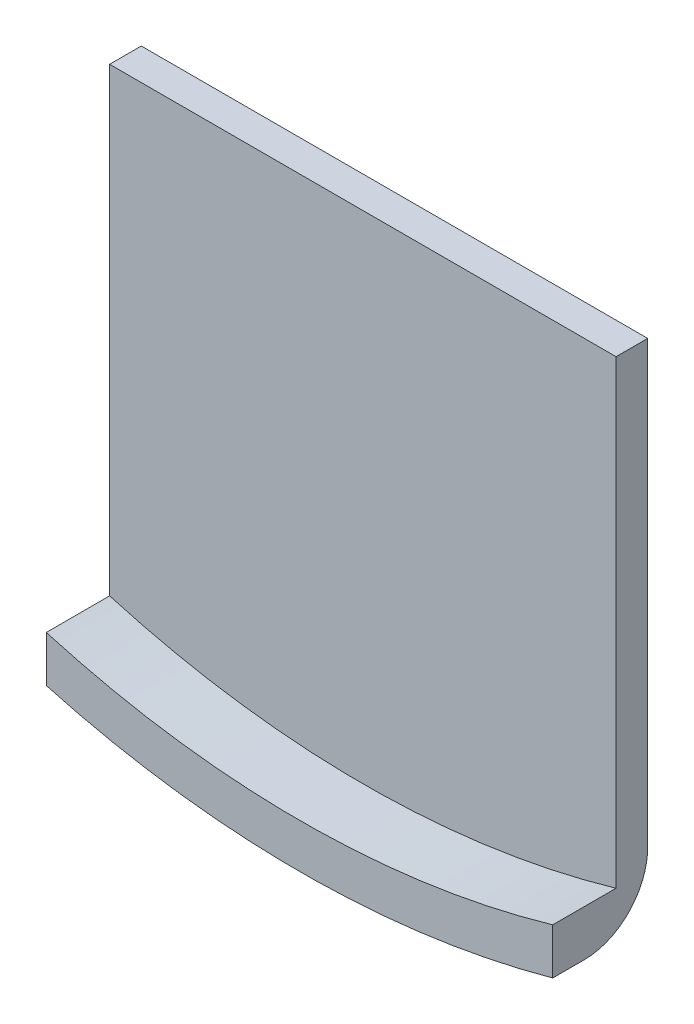
ISO-10303-21;
HEADER;
FILE_DESCRIPTION(('STEP AP214'),'2;1');
FILE_NAME('part.step','',(''),(''),'','','');
FILE_SCHEMA(('AUTOMOTIVE_DESIGN { 1 0 10303 214 1 1 1 1 }'));
ENDSEC;
DATA;
#1=APPLICATION_CONTEXT('core data for automotive mechanical design processes');
#2=APPLICATION_PROTOCOL_DEFINITION('international standard','automotive_design',2000,#1);
#3=PRODUCT_CONTEXT('',#1,'mechanical');
#4=PRODUCT('Part','Part','',(#3));
#5=PRODUCT_RELATED_PRODUCT_CATEGORY('part','',(#4));
#6=PRODUCT_DEFINITION_FORMATION('','',#4);
#7=PRODUCT_DEFINITION_CONTEXT('part definition',#1,'design');
#8=PRODUCT_DEFINITION('design','',#6,#7);
#9=PRODUCT_DEFINITION_SHAPE('','',#8);
#10=(LENGTH_UNIT() NAMED_UNIT(*) SI_UNIT(.MILLI.,.METRE.));
#11=(NAMED_UNIT(*) PLANE_ANGLE_UNIT() SI_UNIT($,.RADIAN.));
#12=(NAMED_UNIT(*) SI_UNIT($,.STERADIAN.) SOLID_ANGLE_UNIT());
#13=UNCERTAINTY_MEASURE_WITH_UNIT(LENGTH_MEASURE(1.E-05),#10,'distance_accuracy_value','');
#14=(GEOMETRIC_REPRESENTATION_CONTEXT(3) GLOBAL_UNCERTAINTY_ASSIGNED_CONTEXT((#13)) GLOBAL_UNIT_ASSIGNED_CONTEXT((#10,
#11,#12)) REPRESENTATION_CONTEXT('',''));
#15=CARTESIAN_POINT('',(0.,0.,0.));
#16=DIRECTION('',(0.,0.,1.));
#17=DIRECTION('',(1.,0.,0.));
#18=AXIS2_PLACEMENT_3D('',#15,#16,#17);
#19=CARTESIAN_POINT('',(-40.,-64.5683229480096,15.));
#20=DIRECTION('',(0.,-1.,0.));
#21=DIRECTION('',(0.,0.,-1.));
#22=AXIS2_PLACEMENT_3D('',#19,#20,#21);
#23=PLANE('',#22);
#24=DIRECTION('',(-1.,0.,0.));
#25=VECTOR('',#24,1.);
#26=CARTESIAN_POINT('',(-40.,-64.5683229480096,5.));
#27=LINE('',#26,#25);
#28=CARTESIAN_POINT('',(40.,-64.5683229480096,5.));
#29=VERTEX_POINT('',#28);
#30=CARTESIAN_POINT('',(-40.,-64.5683229480096,5.));
#31=VERTEX_POINT('',#30);
#32=EDGE_CURVE('E129',#29,#31,#27,.T.);
#33=ORIENTED_EDGE('',*,*,#32,.F.);
#34=DIRECTION('',(0.,0.,-1.));
#35=VECTOR('',#34,1.);
#36=CARTESIAN_POINT('',(40.,-64.5683229480096,15.));
#37=LINE('',#36,#35);
#38=CARTESIAN_POINT('',(40.,-64.5683229480096,0.));
#39=VERTEX_POINT('',#38);
#40=EDGE_CURVE('E127',#29,#39,#37,.T.);
#41=ORIENTED_EDGE('',*,*,#40,.T.);
#42=DIRECTION('',(-1.,0.,0.));
#43=VECTOR('',#42,1.);
#44=CARTESIAN_POINT('',(-40.,-64.5683229480096,0.));
#45=LINE('',#44,#43);
#46=CARTESIAN_POINT('',(-40.,-64.5683229480096,0.));
#47=VERTEX_POINT('',#46);
#48=EDGE_CURVE('E155',#39,#47,#45,.T.);
#49=ORIENTED_EDGE('',*,*,#48,.T.);
#50=DIRECTION('',(0.,0.,-1.));
#51=VECTOR('',#50,1.);
#52=CARTESIAN_POINT('',(-40.,-64.5683229480096,15.));
#53=LINE('',#52,#51);
#54=EDGE_CURVE('E164',#31,#47,#53,.T.);
#55=ORIENTED_EDGE('',*,*,#54,.F.);
#56=EDGE_LOOP('',(#33,#41,#49,#55));
#57=FACE_BOUND('',#56,.T.);
#58=ADVANCED_FACE('F39',(#57),#23,.F.);
#59=CARTESIAN_POINT('',(0.,0.,15.));
#60=DIRECTION('',(0.,0.,-1.));
#61=DIRECTION('',(-1.,0.,0.));
#62=AXIS2_PLACEMENT_3D('',#59,#60,#61);
#63=CYLINDRICAL_SURFACE('',#62,150.);
#64=DIRECTION('',(0.,0.,-1.));
#65=VECTOR('',#64,1.);
#66=CARTESIAN_POINT('',(-40.,-144.56832294801,15.));
#67=LINE('',#66,#65);
#68=CARTESIAN_POINT('',(-40.,-144.56832294801,15.));
#69=VERTEX_POINT('',#68);
#70=CARTESIAN_POINT('',(-40.,-144.56832294801,10.));
#71=VERTEX_POINT('',#70);
#72=EDGE_CURVE('E152',#69,#71,#67,.T.);
#73=ORIENTED_EDGE('',*,*,#72,.T.);
#74=CARTESIAN_POINT('',(0.,0.,10.));
#75=DIRECTION('',(0.,0.,1.));
#76=DIRECTION('',(1.,0.,0.));
#77=AXIS2_PLACEMENT_3D('',#74,#75,#76);
#78=CIRCLE('',#77,150.);
#79=CARTESIAN_POINT('',(40.,-144.56832294801,10.));
#80=VERTEX_POINT('',#79);
#81=EDGE_CURVE('E172',#71,#80,#78,.T.);
#82=ORIENTED_EDGE('',*,*,#81,.T.);
#83=DIRECTION('',(0.,0.,-1.));
#84=VECTOR('',#83,1.);
#85=CARTESIAN_POINT('',(40.,-144.56832294801,15.));
#86=LINE('',#85,#84);
#87=CARTESIAN_POINT('',(40.,-144.56832294801,15.));
#88=VERTEX_POINT('',#87);
#89=EDGE_CURVE('E169',#88,#80,#86,.T.);
#90=ORIENTED_EDGE('',*,*,#89,.F.);
#91=CARTESIAN_POINT('',(0.,0.,15.));
#92=DIRECTION('',(0.,0.,1.));
#93=DIRECTION('',(1.,0.,0.));
#94=AXIS2_PLACEMENT_3D('',#91,#92,#93);
#95=CIRCLE('',#94,150.);
#96=EDGE_CURVE('E141',#69,#88,#95,.T.);
#97=ORIENTED_EDGE('',*,*,#96,.F.);
#98=EDGE_LOOP('',(#73,#82,#90,#97));
#99=FACE_BOUND('',#98,.T.);
#100=ADVANCED_FACE('F186',(#99),#63,.T.);
#101=CARTESIAN_POINT('',(40.,-64.5683229480096,15.));
#102=DIRECTION('',(-1.,0.,0.));
#103=DIRECTION('',(0.,-1.,0.));
#104=AXIS2_PLACEMENT_3D('',#101,#102,#103);
#105=PLANE('',#104);
#106=ORIENTED_EDGE('',*,*,#89,.T.);
#107=CARTESIAN_POINT('',(40.,-144.56832294801,10.));
#108=CARTESIAN_POINT('',(40.,-144.568359035472,9.72626188347201));
#109=CARTESIAN_POINT('',(40.,-144.556662340316,9.45253158487849));
#110=CARTESIAN_POINT('',(40.,-144.510066128344,8.90708385302003));
#111=CARTESIAN_POINT('',(40.,-144.47516931396,8.63536618904336));
#112=CARTESIAN_POINT('',(40.,-144.382514860294,8.09633800191904));
#113=CARTESIAN_POINT('',(40.,-144.324796454121,7.82902073118008));
#114=CARTESIAN_POINT('',(40.,-144.187002586657,7.30021461901987));
#115=CARTESIAN_POINT('',(40.,-144.106927107247,7.03872578232193));
#116=CARTESIAN_POINT('',(40.,-143.925081115136,6.52337484364123));
#117=CARTESIAN_POINT('',(40.,-143.823308199884,6.26951358981309));
#118=CARTESIAN_POINT('',(40.,-143.598912627219,5.77117394913581));
#119=CARTESIAN_POINT('',(40.,-143.476289263047,5.52669588068891));
#120=CARTESIAN_POINT('',(40.,-143.211182020109,5.04874552096158));
#121=CARTESIAN_POINT('',(40.,-143.068697164055,4.81527377200629));
#122=CARTESIAN_POINT('',(40.,-142.764997650342,4.36085271996683));
#123=CARTESIAN_POINT('',(40.,-142.603782854487,4.13990350929671));
#124=CARTESIAN_POINT('',(40.,-142.261370418195,3.70876509600919));
#125=CARTESIAN_POINT('',(40.,-142.07991463779,3.49878093871475));
#126=CARTESIAN_POINT('',(40.,-141.700328569066,3.09434927042743));
#127=CARTESIAN_POINT('',(40.,-141.502192905535,2.89990680751193));
#128=CARTESIAN_POINT('',(40.,-141.090768141169,2.52777801552542));
#129=CARTESIAN_POINT('',(40.,-140.877478862613,2.35009188302719));
#130=CARTESIAN_POINT('',(40.,-140.437278607051,2.01247575031213));
#131=CARTESIAN_POINT('',(40.,-140.210367104579,1.85254643572783));
#132=CARTESIAN_POINT('',(40.,-139.736410431134,1.5460758109461));
#133=CARTESIAN_POINT('',(40.,-139.488939702133,1.40019242583963));
#134=CARTESIAN_POINT('',(40.,-138.982968287429,1.12920553635408));
#135=CARTESIAN_POINT('',(40.,-138.724470700937,1.00409624094301));
#136=CARTESIAN_POINT('',(40.,-138.198139533581,0.775235817273424));
#137=CARTESIAN_POINT('',(40.,-137.930304226177,0.671488663616188));
#138=CARTESIAN_POINT('',(40.,-137.387179725388,0.485902393989954));
#139=CARTESIAN_POINT('',(40.,-137.1118915963,0.404060167882566));
#140=CARTESIAN_POINT('',(40.,-136.615767391316,0.277924895934444));
#141=CARTESIAN_POINT('',(40.,-136.396010518631,0.229339760186271));
#142=CARTESIAN_POINT('',(40.,-135.953893134258,0.145982251654777));
#143=CARTESIAN_POINT('',(40.,-135.731532728138,0.111209320789587));
#144=CARTESIAN_POINT('',(40.,-135.285431887614,0.0556086102170756));
#145=CARTESIAN_POINT('',(40.,-135.061694152764,0.0347591235195763));
#146=CARTESIAN_POINT('',(40.,-134.613330578354,0.00695050811814122));
#147=CARTESIAN_POINT('',(40.,-134.388704637764,-6.99206341696163E-06));
#148=CARTESIAN_POINT('',(40.,-134.164078649987,0.));
#149=B_SPLINE_CURVE_WITH_KNOTS('',3,(#107,#108,#109,#110,#111,#112,#113,#114,#115,#116,#117,
#118,#119,#120,#121,#122,#123,#124,#125,#126,#127,#128,#129,#130,#131,#132,#133,#134,#135,#136,
#137,#138,#139,#140,#141,#142,#143,#144,#145,#146,#147,#148),.UNSPECIFIED.,.F.,.F.,(4,2,2,2,2,2,
2,2,2,2,2,2,2,2,2,2,2,2,2,2,4),(0.,0.820952883759586,1.64181015681192,2.46126236882362,
3.28071524489073,4.10025890590844,4.91983035218551,5.73944213988814,6.55905997538865,
7.39068476193907,8.2225785789477,9.05448215390055,9.88641783944645,10.7472485970723,
11.6078389832484,12.4685893449104,13.3292174293093,14.0039898517018,14.6787350071536,
15.3524257471753,16.0261954576197),.UNSPECIFIED.);
#150=CARTESIAN_POINT('',(40.,-134.164078649987,0.));
#151=VERTEX_POINT('',#150);
#152=EDGE_CURVE('E68',#80,#151,#149,.T.);
#153=ORIENTED_EDGE('',*,*,#152,.T.);
#154=DIRECTION('',(0.,1.,0.));
#155=VECTOR('',#154,1.);
#156=CARTESIAN_POINT('',(40.,-64.5683229480096,0.));
#157=LINE('',#156,#155);
#158=EDGE_CURVE('E139',#151,#39,#157,.T.);
#159=ORIENTED_EDGE('',*,*,#158,.T.);
#160=ORIENTED_EDGE('',*,*,#40,.F.);
#161=DIRECTION('',(0.,1.,0.));
#162=VECTOR('',#161,1.);
#163=CARTESIAN_POINT('',(40.,-64.5683229480096,5.));
#164=LINE('',#163,#162);
#165=CARTESIAN_POINT('',(40.,-137.291660343955,5.));
#166=VERTEX_POINT('',#165);
#167=EDGE_CURVE('E118',#166,#29,#164,.T.);
#168=ORIENTED_EDGE('',*,*,#167,.F.);
#169=DIRECTION('',(0.,0.,1.));
#170=VECTOR('',#169,1.);
#171=CARTESIAN_POINT('',(40.,-137.291660343955,5.));
#172=LINE('',#171,#170);
#173=CARTESIAN_POINT('',(40.,-137.291660343955,15.));
#174=VERTEX_POINT('',#173);
#175=EDGE_CURVE('E103',#166,#174,#172,.T.);
#176=ORIENTED_EDGE('',*,*,#175,.T.);
#177=DIRECTION('',(0.,1.,0.));
#178=VECTOR('',#177,1.);
#179=CARTESIAN_POINT('',(40.,-64.5683229480096,15.));
#180=LINE('',#179,#178);
#181=EDGE_CURVE('E145',#88,#174,#180,.T.);
#182=ORIENTED_EDGE('',*,*,#181,.F.);
#183=EDGE_LOOP('',(#106,#153,#159,#160,#168,#176,#182));
#184=FACE_BOUND('',#183,.T.);
#185=ADVANCED_FACE('F125',(#184),#105,.F.);
#186=CARTESIAN_POINT('',(-40.,-144.56832294801,15.));
#187=DIRECTION('',(1.,0.,0.));
#188=DIRECTION('',(0.,1.,0.));
#189=AXIS2_PLACEMENT_3D('',#186,#187,#188);
#190=PLANE('',#189);
#191=DIRECTION('',(0.,-1.,0.));
#192=VECTOR('',#191,1.);
#193=CARTESIAN_POINT('',(-40.,-144.56832294801,0.));
#194=LINE('',#193,#192);
#195=CARTESIAN_POINT('',(-40.,-134.164078649987,0.));
#196=VERTEX_POINT('',#195);
#197=EDGE_CURVE('E146',#47,#196,#194,.T.);
#198=ORIENTED_EDGE('',*,*,#197,.T.);
#199=CARTESIAN_POINT('',(-40.,-134.164078649987,0.));
#200=CARTESIAN_POINT('',(-40.,-134.465987202941,-2.39595527518265E-05));
#201=CARTESIAN_POINT('',(-40.,-134.767899477535,0.012555323761179));
#202=CARTESIAN_POINT('',(-40.,-135.369648522833,0.06279369056643));
#203=CARTESIAN_POINT('',(-40.,-135.669485162292,0.100454345624216));
#204=CARTESIAN_POINT('',(-40.,-136.265141664081,0.200759058677123));
#205=CARTESIAN_POINT('',(-40.,-136.560958987879,0.263418210067454));
#206=CARTESIAN_POINT('',(-40.,-137.146263315266,0.41341094769574));
#207=CARTESIAN_POINT('',(-40.,-137.435750547601,0.500743640724577));
#208=CARTESIAN_POINT('',(-40.,-138.006593544041,0.699744333568046));
#209=CARTESIAN_POINT('',(-40.,-138.287940187001,0.811438517786292));
#210=CARTESIAN_POINT('',(-40.,-138.840049715946,1.05849250456056));
#211=CARTESIAN_POINT('',(-40.,-139.110812640105,1.19385222174744));
#212=CARTESIAN_POINT('',(-40.,-139.639500488651,1.4873691713725));
#213=CARTESIAN_POINT('',(-40.,-139.897432335986,1.64551392677204));
#214=CARTESIAN_POINT('',(-40.,-140.398532708538,1.98368164261669));
#215=CARTESIAN_POINT('',(-40.,-140.641701667589,2.16370395968197));
#216=CARTESIAN_POINT('',(-40.,-141.105870141456,2.54009725066669));
#217=CARTESIAN_POINT('',(-40.,-141.327249842366,2.73599937675167));
#218=CARTESIAN_POINT('',(-40.,-141.752147579857,3.14629789910924));
#219=CARTESIAN_POINT('',(-40.,-141.955666321474,3.36069356471283));
#220=CARTESIAN_POINT('',(-40.,-142.343145289896,3.80656415878805));
#221=CARTESIAN_POINT('',(-40.,-142.527101805514,4.03804231395132));
#222=CARTESIAN_POINT('',(-40.,-142.873777718169,4.51638409837735));
#223=CARTESIAN_POINT('',(-40.,-143.036498232104,4.76324691748007));
#224=CARTESIAN_POINT('',(-40.,-143.333455567899,5.26086173728838));
#225=CARTESIAN_POINT('',(-40.,-143.468541241983,5.51110745111039));
#226=CARTESIAN_POINT('',(-40.,-143.716520396778,6.0223524845566));
#227=CARTESIAN_POINT('',(-40.,-143.829415178156,6.28335117283531));
#228=CARTESIAN_POINT('',(-40.,-144.031922675609,6.81396207839342));
#229=CARTESIAN_POINT('',(-40.,-144.121556783862,7.08356612342291));
#230=CARTESIAN_POINT('',(-40.,-144.276839895717,7.62947819685111));
#231=CARTESIAN_POINT('',(-40.,-144.342497283409,7.90578384574711));
#232=CARTESIAN_POINT('',(-40.,-144.453199682746,8.48367392881396));
#233=CARTESIAN_POINT('',(-40.,-144.496372683838,8.78562251276978));
#234=CARTESIAN_POINT('',(-40.,-144.539539441546,9.24025996913471));
#235=CARTESIAN_POINT('',(-40.,-144.550329557686,9.39199769085177));
#236=CARTESIAN_POINT('',(-40.,-144.564721351479,9.69581543929119));
#237=CARTESIAN_POINT('',(-40.,-144.568322944374,9.84789547002847));
#238=CARTESIAN_POINT('',(-40.,-144.56832294801,10.));
#239=B_SPLINE_CURVE_WITH_KNOTS('',3,(#199,#200,#201,#202,#203,#204,#205,#206,#207,#208,#209,
#210,#211,#212,#213,#214,#215,#216,#217,#218,#219,#220,#221,#222,#223,#224,#225,#226,#227,#228,
#229,#230,#231,#232,#233,#234,#235,#236,#237,#238),.UNSPECIFIED.,.F.,.F.,(4,2,2,2,2,2,2,2,2,2,2,
2,2,2,2,2,2,2,2,4),(0.,0.905470004576359,1.81099675007617,2.71707105679736,3.62311256684243,
4.53013275695387,5.43714967522091,6.34367178749364,7.2501672470258,8.13590181946816,
9.02160141306667,9.90746873576922,10.7932894478436,11.6453697367217,12.4974000680244,
13.3486440118379,14.1995900101399,15.1131452912166,15.5693620346243,16.0255841571426),.UNSPECIFIED.);
#240=EDGE_CURVE('E11',#196,#71,#239,.T.);
#241=ORIENTED_EDGE('',*,*,#240,.T.);
#242=ORIENTED_EDGE('',*,*,#72,.F.);
#243=DIRECTION('',(0.,-1.,0.));
#244=VECTOR('',#243,1.);
#245=CARTESIAN_POINT('',(-40.,-144.56832294801,15.));
#246=LINE('',#245,#244);
#247=CARTESIAN_POINT('',(-40.,-137.291660343955,15.));
#248=VERTEX_POINT('',#247);
#249=EDGE_CURVE('E149',#248,#69,#246,.T.);
#250=ORIENTED_EDGE('',*,*,#249,.F.);
#251=DIRECTION('',(0.,0.,1.));
#252=VECTOR('',#251,1.);
#253=CARTESIAN_POINT('',(-40.,-137.291660343955,5.));
#254=LINE('',#253,#252);
#255=CARTESIAN_POINT('',(-40.,-137.291660343955,5.));
#256=VERTEX_POINT('',#255);
#257=EDGE_CURVE('E113',#256,#248,#254,.T.);
#258=ORIENTED_EDGE('',*,*,#257,.F.);
#259=DIRECTION('',(0.,-1.,0.));
#260=VECTOR('',#259,1.);
#261=CARTESIAN_POINT('',(-40.,-137.291660343955,5.));
#262=LINE('',#261,#260);
#263=EDGE_CURVE('E114',#31,#256,#262,.T.);
#264=ORIENTED_EDGE('',*,*,#263,.F.);
#265=ORIENTED_EDGE('',*,*,#54,.T.);
#266=EDGE_LOOP('',(#198,#241,#242,#250,#258,#264,#265));
#267=FACE_BOUND('',#266,.T.);
#268=ADVANCED_FACE('F185',(#267),#190,.F.);
#269=CARTESIAN_POINT('',(0.,0.,15.));
#270=DIRECTION('',(0.,0.,1.));
#271=DIRECTION('',(1.,0.,0.));
#272=AXIS2_PLACEMENT_3D('',#269,#270,#271);
#273=PLANE('',#272);
#274=CARTESIAN_POINT('',(0.,0.,15.));
#275=DIRECTION('',(0.,0.,1.));
#276=DIRECTION('',(1.,0.,0.));
#277=AXIS2_PLACEMENT_3D('',#274,#275,#276);
#278=CIRCLE('',#277,143.);
#279=EDGE_CURVE('E109',#248,#174,#278,.T.);
#280=ORIENTED_EDGE('',*,*,#279,.F.);
#281=ORIENTED_EDGE('',*,*,#249,.T.);
#282=ORIENTED_EDGE('',*,*,#96,.T.);
#283=ORIENTED_EDGE('',*,*,#181,.T.);
#284=EDGE_LOOP('',(#280,#281,#282,#283));
#285=FACE_BOUND('',#284,.T.);
#286=ADVANCED_FACE('F206',(#285),#273,.T.);
#287=CARTESIAN_POINT('',(0.,0.,0.));
#288=DIRECTION('',(0.,0.,1.));
#289=DIRECTION('',(1.,0.,0.));
#290=AXIS2_PLACEMENT_3D('',#287,#288,#289);
#291=PLANE('',#290);
#292=ORIENTED_EDGE('',*,*,#158,.F.);
#293=CARTESIAN_POINT('',(0.,0.,0.));
#294=DIRECTION('',(0.,0.,1.));
#295=DIRECTION('',(1.,0.,0.));
#296=AXIS2_PLACEMENT_3D('',#293,#294,#295);
#297=CIRCLE('',#296,140.);
#298=EDGE_CURVE('E54',#151,#196,#297,.F.);
#299=ORIENTED_EDGE('',*,*,#298,.T.);
#300=ORIENTED_EDGE('',*,*,#197,.F.);
#301=ORIENTED_EDGE('',*,*,#48,.F.);
#302=EDGE_LOOP('',(#292,#299,#300,#301));
#303=FACE_BOUND('',#302,.T.);
#304=ADVANCED_FACE('F204',(#303),#291,.F.);
#305=CARTESIAN_POINT('',(0.,0.,5.));
#306=DIRECTION('',(0.,0.,1.));
#307=DIRECTION('',(1.,0.,0.));
#308=AXIS2_PLACEMENT_3D('',#305,#306,#307);
#309=CYLINDRICAL_SURFACE('',#308,143.);
#310=ORIENTED_EDGE('',*,*,#279,.T.);
#311=ORIENTED_EDGE('',*,*,#175,.F.);
#312=CARTESIAN_POINT('',(0.,0.,5.));
#313=DIRECTION('',(0.,0.,1.));
#314=DIRECTION('',(1.,0.,0.));
#315=AXIS2_PLACEMENT_3D('',#312,#313,#314);
#316=CIRCLE('',#315,143.);
#317=EDGE_CURVE('E106',#256,#166,#316,.T.);
#318=ORIENTED_EDGE('',*,*,#317,.F.);
#319=ORIENTED_EDGE('',*,*,#257,.T.);
#320=EDGE_LOOP('',(#310,#311,#318,#319));
#321=FACE_BOUND('',#320,.T.);
#322=ADVANCED_FACE('F105',(#321),#309,.F.);
#323=CARTESIAN_POINT('',(0.,0.,5.));
#324=DIRECTION('',(0.,0.,1.));
#325=DIRECTION('',(1.,0.,0.));
#326=AXIS2_PLACEMENT_3D('',#323,#324,#325);
#327=PLANE('',#326);
#328=ORIENTED_EDGE('',*,*,#317,.T.);
#329=ORIENTED_EDGE('',*,*,#167,.T.);
#330=ORIENTED_EDGE('',*,*,#32,.T.);
#331=ORIENTED_EDGE('',*,*,#263,.T.);
#332=EDGE_LOOP('',(#328,#329,#330,#331));
#333=FACE_BOUND('',#332,.T.);
#334=ADVANCED_FACE('F117',(#333),#327,.T.);
#335=CARTESIAN_POINT('',(0.,0.,10.));
#336=DIRECTION('',(0.,0.,1.));
#337=DIRECTION('',(1.,0.,0.));
#338=AXIS2_PLACEMENT_3D('',#335,#336,#337);
#339=TOROIDAL_SURFACE('',#338,140.,10.);
#340=ORIENTED_EDGE('',*,*,#240,.F.);
#341=ORIENTED_EDGE('',*,*,#298,.F.);
#342=ORIENTED_EDGE('',*,*,#152,.F.);
#343=ORIENTED_EDGE('',*,*,#81,.F.);
#344=EDGE_LOOP('',(#340,#341,#342,#343));
#345=FACE_BOUND('',#344,.T.);
#346=ADVANCED_FACE('F41',(#345),#339,.T.);
#347=CLOSED_SHELL('',(#58,#100,#185,#268,#286,#304,#322,#334,#346));
#348=MANIFOLD_SOLID_BREP('B2',#347);
#349=ADVANCED_BREP_SHAPE_REPRESENTATION('',(#18,#348),#14);
#350=SHAPE_DEFINITION_REPRESENTATION(#9,#349);
ENDSEC;
END-ISO-10303-21;
